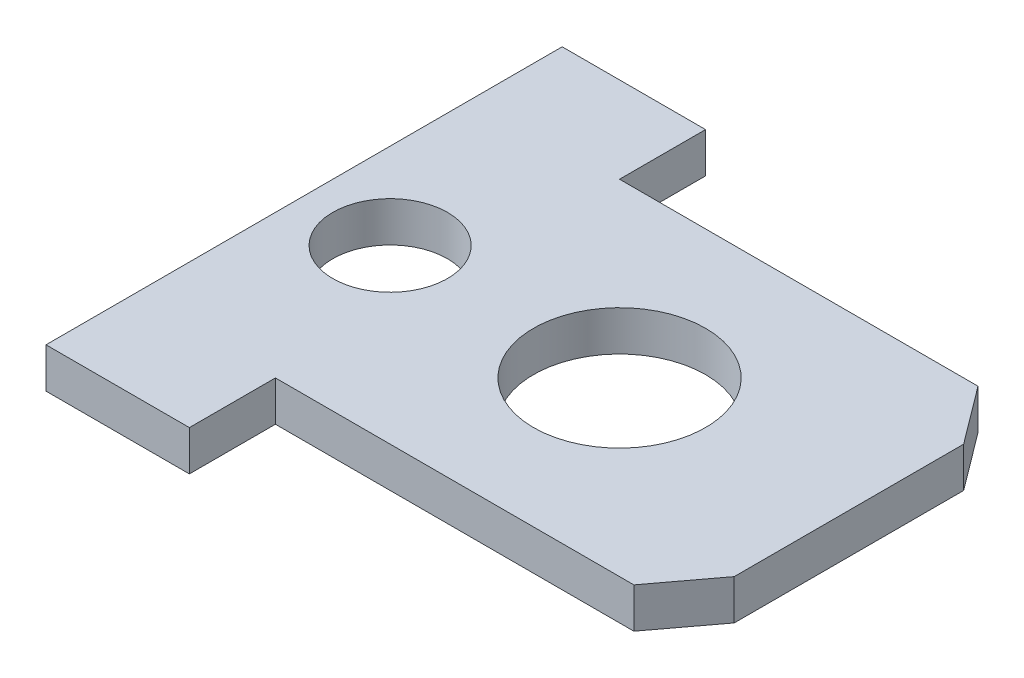
ISO-10303-21;
HEADER;
FILE_DESCRIPTION(('STEP AP214'),'2;1');
FILE_NAME('part.step','',(''),(''),'','','');
FILE_SCHEMA(('AUTOMOTIVE_DESIGN { 1 0 10303 214 1 1 1 1 }'));
ENDSEC;
DATA;
#1=APPLICATION_CONTEXT('core data for automotive mechanical design processes');
#2=APPLICATION_PROTOCOL_DEFINITION('international standard','automotive_design',2000,#1);
#3=PRODUCT_CONTEXT('',#1,'mechanical');
#4=PRODUCT('Part','Part','',(#3));
#5=PRODUCT_RELATED_PRODUCT_CATEGORY('part','',(#4));
#6=PRODUCT_DEFINITION_FORMATION('','',#4);
#7=PRODUCT_DEFINITION_CONTEXT('part definition',#1,'design');
#8=PRODUCT_DEFINITION('design','',#6,#7);
#9=PRODUCT_DEFINITION_SHAPE('','',#8);
#10=(LENGTH_UNIT() NAMED_UNIT(*) SI_UNIT(.MILLI.,.METRE.));
#11=(NAMED_UNIT(*) PLANE_ANGLE_UNIT() SI_UNIT($,.RADIAN.));
#12=(NAMED_UNIT(*) SI_UNIT($,.STERADIAN.) SOLID_ANGLE_UNIT());
#13=UNCERTAINTY_MEASURE_WITH_UNIT(LENGTH_MEASURE(1.E-05),#10,'distance_accuracy_value','');
#14=(GEOMETRIC_REPRESENTATION_CONTEXT(3) GLOBAL_UNCERTAINTY_ASSIGNED_CONTEXT((#13)) GLOBAL_UNIT_ASSIGNED_CONTEXT((#10,
#11,#12)) REPRESENTATION_CONTEXT('',''));
#15=CARTESIAN_POINT('',(0.,0.,0.));
#16=DIRECTION('',(0.,0.,1.));
#17=DIRECTION('',(1.,0.,0.));
#18=AXIS2_PLACEMENT_3D('',#15,#16,#17);
#19=CARTESIAN_POINT('',(16.,102.45,112.5));
#20=DIRECTION('',(0.,-1.,0.));
#21=DIRECTION('',(0.,0.,-1.));
#22=AXIS2_PLACEMENT_3D('',#19,#20,#21);
#23=PLANE('',#22);
#24=CARTESIAN_POINT('',(21.5,102.45,112.5));
#25=DIRECTION('',(0.,-1.,0.));
#26=DIRECTION('',(0.,0.,-1.));
#27=AXIS2_PLACEMENT_3D('',#24,#25,#26);
#28=CIRCLE('',#27,1.5);
#29=CARTESIAN_POINT('',(21.5,102.45,111.));
#30=VERTEX_POINT('',#29);
#31=EDGE_CURVE('E121',#30,#30,#28,.F.);
#32=ORIENTED_EDGE('',*,*,#31,.T.);
#33=EDGE_LOOP('',(#32));
#34=FACE_BOUND('',#33,.T.);
#35=CARTESIAN_POINT('',(17.5,102.45,112.5));
#36=DIRECTION('',(0.,-1.,0.));
#37=DIRECTION('',(0.,0.,-1.));
#38=AXIS2_PLACEMENT_3D('',#35,#36,#37);
#39=CIRCLE('',#38,1.);
#40=CARTESIAN_POINT('',(17.5,102.45,111.5));
#41=VERTEX_POINT('',#40);
#42=EDGE_CURVE('E20',#41,#41,#39,.F.);
#43=ORIENTED_EDGE('',*,*,#42,.T.);
#44=EDGE_LOOP('',(#43));
#45=FACE_BOUND('',#44,.T.);
#46=DIRECTION('',(-1.,0.,0.));
#47=VECTOR('',#46,1.);
#48=CARTESIAN_POINT('',(16.,102.45,108.));
#49=LINE('',#48,#47);
#50=CARTESIAN_POINT('',(18.5,102.45,108.));
#51=VERTEX_POINT('',#50);
#52=CARTESIAN_POINT('',(16.,102.45,108.));
#53=VERTEX_POINT('',#52);
#54=EDGE_CURVE('E152',#51,#53,#49,.T.);
#55=ORIENTED_EDGE('',*,*,#54,.F.);
#56=DIRECTION('',(0.,0.,-1.));
#57=VECTOR('',#56,1.);
#58=CARTESIAN_POINT('',(18.5,102.45,112.));
#59=LINE('',#58,#57);
#60=CARTESIAN_POINT('',(18.5,102.45,109.5));
#61=VERTEX_POINT('',#60);
#62=EDGE_CURVE('E157',#61,#51,#59,.T.);
#63=ORIENTED_EDGE('',*,*,#62,.F.);
#64=DIRECTION('',(-1.,0.,0.));
#65=VECTOR('',#64,1.);
#66=CARTESIAN_POINT('',(16.,102.45,109.5));
#67=LINE('',#66,#65);
#68=CARTESIAN_POINT('',(24.75,102.45,109.5));
#69=VERTEX_POINT('',#68);
#70=EDGE_CURVE('E162',#69,#61,#67,.T.);
#71=ORIENTED_EDGE('',*,*,#70,.F.);
#72=DIRECTION('',(-0.6,0.,-0.8));
#73=VECTOR('',#72,1.);
#74=CARTESIAN_POINT('',(25.125,102.45,110.));
#75=LINE('',#74,#73);
#76=CARTESIAN_POINT('',(25.5,102.45,110.5));
#77=VERTEX_POINT('',#76);
#78=EDGE_CURVE('E108',#77,#69,#75,.T.);
#79=ORIENTED_EDGE('',*,*,#78,.F.);
#80=DIRECTION('',(0.,0.,-1.));
#81=VECTOR('',#80,1.);
#82=CARTESIAN_POINT('',(25.5,102.45,112.));
#83=LINE('',#82,#81);
#84=CARTESIAN_POINT('',(25.5,102.45,114.5));
#85=VERTEX_POINT('',#84);
#86=EDGE_CURVE('E91',#85,#77,#83,.T.);
#87=ORIENTED_EDGE('',*,*,#86,.F.);
#88=DIRECTION('',(0.6,0.,-0.8));
#89=VECTOR('',#88,1.);
#90=CARTESIAN_POINT('',(25.125,102.45,115.));
#91=LINE('',#90,#89);
#92=CARTESIAN_POINT('',(24.75,102.45,115.5));
#93=VERTEX_POINT('',#92);
#94=EDGE_CURVE('E96',#93,#85,#91,.T.);
#95=ORIENTED_EDGE('',*,*,#94,.F.);
#96=DIRECTION('',(1.,0.,0.));
#97=VECTOR('',#96,1.);
#98=CARTESIAN_POINT('',(16.,102.45,115.5));
#99=LINE('',#98,#97);
#100=CARTESIAN_POINT('',(18.5,102.45,115.5));
#101=VERTEX_POINT('',#100);
#102=EDGE_CURVE('E128',#101,#93,#99,.T.);
#103=ORIENTED_EDGE('',*,*,#102,.F.);
#104=DIRECTION('',(0.,0.,-1.));
#105=VECTOR('',#104,1.);
#106=CARTESIAN_POINT('',(18.5,102.45,112.));
#107=LINE('',#106,#105);
#108=CARTESIAN_POINT('',(18.5,102.45,117.));
#109=VERTEX_POINT('',#108);
#110=EDGE_CURVE('E137',#109,#101,#107,.T.);
#111=ORIENTED_EDGE('',*,*,#110,.F.);
#112=DIRECTION('',(1.,0.,0.));
#113=VECTOR('',#112,1.);
#114=CARTESIAN_POINT('',(16.,102.45,117.));
#115=LINE('',#114,#113);
#116=CARTESIAN_POINT('',(16.,102.45,117.));
#117=VERTEX_POINT('',#116);
#118=EDGE_CURVE('E142',#117,#109,#115,.T.);
#119=ORIENTED_EDGE('',*,*,#118,.F.);
#120=DIRECTION('',(0.,0.,-1.));
#121=VECTOR('',#120,1.);
#122=CARTESIAN_POINT('',(16.,102.45,112.));
#123=LINE('',#122,#121);
#124=EDGE_CURVE('E147',#117,#53,#123,.T.);
#125=ORIENTED_EDGE('',*,*,#124,.T.);
#126=EDGE_LOOP('',(#55,#63,#71,#79,#87,#95,#103,#111,#119,#125));
#127=FACE_BOUND('',#126,.T.);
#128=ADVANCED_FACE('F17',(#34,#45,#127),#23,.T.);
#129=CARTESIAN_POINT('',(25.125,102.45,115.));
#130=DIRECTION('',(0.8,0.,0.6));
#131=DIRECTION('',(0.6,0.,-0.8));
#132=AXIS2_PLACEMENT_3D('',#129,#130,#131);
#133=PLANE('',#132);
#134=ORIENTED_EDGE('',*,*,#94,.T.);
#135=DIRECTION('',(0.,1.,0.));
#136=VECTOR('',#135,1.);
#137=CARTESIAN_POINT('',(25.5,102.8,114.5));
#138=LINE('',#137,#136);
#139=CARTESIAN_POINT('',(25.5,103.15,114.5));
#140=VERTEX_POINT('',#139);
#141=EDGE_CURVE('E98',#140,#85,#138,.F.);
#142=ORIENTED_EDGE('',*,*,#141,.F.);
#143=DIRECTION('',(0.6,0.,-0.8));
#144=VECTOR('',#143,1.);
#145=CARTESIAN_POINT('',(24.75,103.15,115.5));
#146=LINE('',#145,#144);
#147=CARTESIAN_POINT('',(24.75,103.15,115.5));
#148=VERTEX_POINT('',#147);
#149=EDGE_CURVE('E123',#148,#140,#146,.T.);
#150=ORIENTED_EDGE('',*,*,#149,.F.);
#151=DIRECTION('',(0.,1.,0.));
#152=VECTOR('',#151,1.);
#153=CARTESIAN_POINT('',(24.75,102.8,115.5));
#154=LINE('',#153,#152);
#155=EDGE_CURVE('E101',#93,#148,#154,.T.);
#156=ORIENTED_EDGE('',*,*,#155,.F.);
#157=EDGE_LOOP('',(#134,#142,#150,#156));
#158=FACE_BOUND('',#157,.T.);
#159=ADVANCED_FACE('F97',(#158),#133,.T.);
#160=CARTESIAN_POINT('',(25.5,102.8,112.));
#161=DIRECTION('',(1.,0.,0.));
#162=DIRECTION('',(0.,0.,-1.));
#163=AXIS2_PLACEMENT_3D('',#160,#161,#162);
#164=PLANE('',#163);
#165=ORIENTED_EDGE('',*,*,#141,.T.);
#166=ORIENTED_EDGE('',*,*,#86,.T.);
#167=DIRECTION('',(0.,1.,0.));
#168=VECTOR('',#167,1.);
#169=CARTESIAN_POINT('',(25.5,102.45,110.5));
#170=LINE('',#169,#168);
#171=CARTESIAN_POINT('',(25.5,103.15,110.5));
#172=VERTEX_POINT('',#171);
#173=EDGE_CURVE('E110',#172,#77,#170,.F.);
#174=ORIENTED_EDGE('',*,*,#173,.F.);
#175=DIRECTION('',(0.,0.,1.));
#176=VECTOR('',#175,1.);
#177=CARTESIAN_POINT('',(25.5,103.15,112.5));
#178=LINE('',#177,#176);
#179=EDGE_CURVE('E114',#140,#172,#178,.F.);
#180=ORIENTED_EDGE('',*,*,#179,.F.);
#181=EDGE_LOOP('',(#165,#166,#174,#180));
#182=FACE_BOUND('',#181,.T.);
#183=ADVANCED_FACE('F112',(#182),#164,.T.);
#184=CARTESIAN_POINT('',(25.125,102.45,110.));
#185=DIRECTION('',(0.8,0.,-0.6));
#186=DIRECTION('',(-0.6,0.,-0.8));
#187=AXIS2_PLACEMENT_3D('',#184,#185,#186);
#188=PLANE('',#187);
#189=ORIENTED_EDGE('',*,*,#78,.T.);
#190=DIRECTION('',(0.,1.,0.));
#191=VECTOR('',#190,1.);
#192=CARTESIAN_POINT('',(24.75,102.8,109.5));
#193=LINE('',#192,#191);
#194=CARTESIAN_POINT('',(24.75,103.15,109.5));
#195=VERTEX_POINT('',#194);
#196=EDGE_CURVE('E164',#195,#69,#193,.F.);
#197=ORIENTED_EDGE('',*,*,#196,.F.);
#198=DIRECTION('',(-0.6,0.,-0.8));
#199=VECTOR('',#198,1.);
#200=CARTESIAN_POINT('',(25.5,103.15,110.5));
#201=LINE('',#200,#199);
#202=EDGE_CURVE('E171',#172,#195,#201,.T.);
#203=ORIENTED_EDGE('',*,*,#202,.F.);
#204=ORIENTED_EDGE('',*,*,#173,.T.);
#205=EDGE_LOOP('',(#189,#197,#203,#204));
#206=FACE_BOUND('',#205,.T.);
#207=ADVANCED_FACE('F169',(#206),#188,.T.);
#208=CARTESIAN_POINT('',(16.,102.8,109.5));
#209=DIRECTION('',(0.,0.,-1.));
#210=DIRECTION('',(-1.,0.,0.));
#211=AXIS2_PLACEMENT_3D('',#208,#209,#210);
#212=PLANE('',#211);
#213=ORIENTED_EDGE('',*,*,#70,.T.);
#214=DIRECTION('',(0.,1.,0.));
#215=VECTOR('',#214,1.);
#216=CARTESIAN_POINT('',(18.5,102.8,109.5));
#217=LINE('',#216,#215);
#218=CARTESIAN_POINT('',(18.5,103.15,109.5));
#219=VERTEX_POINT('',#218);
#220=EDGE_CURVE('E159',#219,#61,#217,.F.);
#221=ORIENTED_EDGE('',*,*,#220,.F.);
#222=DIRECTION('',(1.,0.,0.));
#223=VECTOR('',#222,1.);
#224=CARTESIAN_POINT('',(16.,103.15,109.5));
#225=LINE('',#224,#223);
#226=EDGE_CURVE('E175',#195,#219,#225,.F.);
#227=ORIENTED_EDGE('',*,*,#226,.F.);
#228=ORIENTED_EDGE('',*,*,#196,.T.);
#229=EDGE_LOOP('',(#213,#221,#227,#228));
#230=FACE_BOUND('',#229,.T.);
#231=ADVANCED_FACE('F284',(#230),#212,.T.);
#232=CARTESIAN_POINT('',(18.5,102.8,112.));
#233=DIRECTION('',(1.,0.,0.));
#234=DIRECTION('',(0.,0.,-1.));
#235=AXIS2_PLACEMENT_3D('',#232,#233,#234);
#236=PLANE('',#235);
#237=ORIENTED_EDGE('',*,*,#220,.T.);
#238=ORIENTED_EDGE('',*,*,#62,.T.);
#239=DIRECTION('',(0.,1.,0.));
#240=VECTOR('',#239,1.);
#241=CARTESIAN_POINT('',(18.5,102.8,108.));
#242=LINE('',#241,#240);
#243=CARTESIAN_POINT('',(18.5,103.15,108.));
#244=VERTEX_POINT('',#243);
#245=EDGE_CURVE('E154',#244,#51,#242,.F.);
#246=ORIENTED_EDGE('',*,*,#245,.F.);
#247=DIRECTION('',(0.,0.,1.));
#248=VECTOR('',#247,1.);
#249=CARTESIAN_POINT('',(18.5,103.15,112.5));
#250=LINE('',#249,#248);
#251=EDGE_CURVE('E182',#219,#244,#250,.F.);
#252=ORIENTED_EDGE('',*,*,#251,.F.);
#253=EDGE_LOOP('',(#237,#238,#246,#252));
#254=FACE_BOUND('',#253,.T.);
#255=ADVANCED_FACE('F274',(#254),#236,.T.);
#256=CARTESIAN_POINT('',(16.,102.8,108.));
#257=DIRECTION('',(0.,0.,-1.));
#258=DIRECTION('',(-1.,0.,0.));
#259=AXIS2_PLACEMENT_3D('',#256,#257,#258);
#260=PLANE('',#259);
#261=ORIENTED_EDGE('',*,*,#245,.T.);
#262=ORIENTED_EDGE('',*,*,#54,.T.);
#263=DIRECTION('',(0.,1.,0.));
#264=VECTOR('',#263,1.);
#265=CARTESIAN_POINT('',(16.,102.8,108.));
#266=LINE('',#265,#264);
#267=CARTESIAN_POINT('',(16.,103.15,108.));
#268=VERTEX_POINT('',#267);
#269=EDGE_CURVE('E150',#53,#268,#266,.T.);
#270=ORIENTED_EDGE('',*,*,#269,.T.);
#271=DIRECTION('',(1.,0.,0.));
#272=VECTOR('',#271,1.);
#273=CARTESIAN_POINT('',(16.,103.15,108.));
#274=LINE('',#273,#272);
#275=EDGE_CURVE('E185',#244,#268,#274,.F.);
#276=ORIENTED_EDGE('',*,*,#275,.F.);
#277=EDGE_LOOP('',(#261,#262,#270,#276));
#278=FACE_BOUND('',#277,.T.);
#279=ADVANCED_FACE('F264',(#278),#260,.T.);
#280=CARTESIAN_POINT('',(16.,102.8,112.));
#281=DIRECTION('',(1.,0.,0.));
#282=DIRECTION('',(0.,0.,-1.));
#283=AXIS2_PLACEMENT_3D('',#280,#281,#282);
#284=PLANE('',#283);
#285=DIRECTION('',(0.,1.,0.));
#286=VECTOR('',#285,1.);
#287=CARTESIAN_POINT('',(16.,102.8,117.));
#288=LINE('',#287,#286);
#289=CARTESIAN_POINT('',(16.,103.15,117.));
#290=VERTEX_POINT('',#289);
#291=EDGE_CURVE('E144',#290,#117,#288,.F.);
#292=ORIENTED_EDGE('',*,*,#291,.F.);
#293=DIRECTION('',(0.,0.,1.));
#294=VECTOR('',#293,1.);
#295=CARTESIAN_POINT('',(16.,103.15,112.5));
#296=LINE('',#295,#294);
#297=EDGE_CURVE('E188',#268,#290,#296,.T.);
#298=ORIENTED_EDGE('',*,*,#297,.F.);
#299=ORIENTED_EDGE('',*,*,#269,.F.);
#300=ORIENTED_EDGE('',*,*,#124,.F.);
#301=EDGE_LOOP('',(#292,#298,#299,#300));
#302=FACE_BOUND('',#301,.T.);
#303=ADVANCED_FACE('F254',(#302),#284,.F.);
#304=CARTESIAN_POINT('',(16.,102.8,117.));
#305=DIRECTION('',(0.,0.,1.));
#306=DIRECTION('',(1.,0.,0.));
#307=AXIS2_PLACEMENT_3D('',#304,#305,#306);
#308=PLANE('',#307);
#309=ORIENTED_EDGE('',*,*,#291,.T.);
#310=ORIENTED_EDGE('',*,*,#118,.T.);
#311=DIRECTION('',(0.,1.,0.));
#312=VECTOR('',#311,1.);
#313=CARTESIAN_POINT('',(18.5,102.8,117.));
#314=LINE('',#313,#312);
#315=CARTESIAN_POINT('',(18.5,103.15,117.));
#316=VERTEX_POINT('',#315);
#317=EDGE_CURVE('E139',#316,#109,#314,.F.);
#318=ORIENTED_EDGE('',*,*,#317,.F.);
#319=DIRECTION('',(1.,0.,0.));
#320=VECTOR('',#319,1.);
#321=CARTESIAN_POINT('',(16.,103.15,117.));
#322=LINE('',#321,#320);
#323=EDGE_CURVE('E191',#290,#316,#322,.T.);
#324=ORIENTED_EDGE('',*,*,#323,.F.);
#325=EDGE_LOOP('',(#309,#310,#318,#324));
#326=FACE_BOUND('',#325,.T.);
#327=ADVANCED_FACE('F209',(#326),#308,.T.);
#328=CARTESIAN_POINT('',(18.5,102.8,112.));
#329=DIRECTION('',(1.,0.,0.));
#330=DIRECTION('',(0.,0.,-1.));
#331=AXIS2_PLACEMENT_3D('',#328,#329,#330);
#332=PLANE('',#331);
#333=ORIENTED_EDGE('',*,*,#110,.T.);
#334=DIRECTION('',(0.,1.,0.));
#335=VECTOR('',#334,1.);
#336=CARTESIAN_POINT('',(18.5,102.8,115.5));
#337=LINE('',#336,#335);
#338=CARTESIAN_POINT('',(18.5,103.15,115.5));
#339=VERTEX_POINT('',#338);
#340=EDGE_CURVE('E35',#339,#101,#337,.F.);
#341=ORIENTED_EDGE('',*,*,#340,.F.);
#342=DIRECTION('',(0.,0.,1.));
#343=VECTOR('',#342,1.);
#344=CARTESIAN_POINT('',(18.5,103.15,112.5));
#345=LINE('',#344,#343);
#346=EDGE_CURVE('E194',#316,#339,#345,.F.);
#347=ORIENTED_EDGE('',*,*,#346,.F.);
#348=ORIENTED_EDGE('',*,*,#317,.T.);
#349=EDGE_LOOP('',(#333,#341,#347,#348));
#350=FACE_BOUND('',#349,.T.);
#351=ADVANCED_FACE('F199',(#350),#332,.T.);
#352=CARTESIAN_POINT('',(16.,102.8,115.5));
#353=DIRECTION('',(0.,0.,1.));
#354=DIRECTION('',(1.,0.,0.));
#355=AXIS2_PLACEMENT_3D('',#352,#353,#354);
#356=PLANE('',#355);
#357=ORIENTED_EDGE('',*,*,#340,.T.);
#358=ORIENTED_EDGE('',*,*,#102,.T.);
#359=ORIENTED_EDGE('',*,*,#155,.T.);
#360=DIRECTION('',(1.,0.,0.));
#361=VECTOR('',#360,1.);
#362=CARTESIAN_POINT('',(16.,103.15,115.5));
#363=LINE('',#362,#361);
#364=EDGE_CURVE('E120',#339,#148,#363,.T.);
#365=ORIENTED_EDGE('',*,*,#364,.F.);
#366=EDGE_LOOP('',(#357,#358,#359,#365));
#367=FACE_BOUND('',#366,.T.);
#368=ADVANCED_FACE('F196',(#367),#356,.T.);
#369=CARTESIAN_POINT('',(17.5,102.45,112.5));
#370=DIRECTION('',(0.,-1.,0.));
#371=DIRECTION('',(0.,0.,-1.));
#372=AXIS2_PLACEMENT_3D('',#369,#370,#371);
#373=CYLINDRICAL_SURFACE('',#372,1.);
#374=ORIENTED_EDGE('',*,*,#42,.F.);
#375=EDGE_LOOP('',(#374));
#376=FACE_BOUND('',#375,.T.);
#377=CARTESIAN_POINT('',(17.5,103.15,112.5));
#378=DIRECTION('',(0.,-1.,0.));
#379=DIRECTION('',(0.,0.,-1.));
#380=AXIS2_PLACEMENT_3D('',#377,#378,#379);
#381=CIRCLE('',#380,1.);
#382=CARTESIAN_POINT('',(17.5,103.15,111.5));
#383=VERTEX_POINT('',#382);
#384=EDGE_CURVE('E26',#383,#383,#381,.T.);
#385=ORIENTED_EDGE('',*,*,#384,.F.);
#386=EDGE_LOOP('',(#385));
#387=FACE_BOUND('',#386,.T.);
#388=ADVANCED_FACE('F198',(#376,#387),#373,.F.);
#389=CARTESIAN_POINT('',(21.5,102.45,112.5));
#390=DIRECTION('',(0.,-1.,0.));
#391=DIRECTION('',(0.,0.,-1.));
#392=AXIS2_PLACEMENT_3D('',#389,#390,#391);
#393=CYLINDRICAL_SURFACE('',#392,1.5);
#394=ORIENTED_EDGE('',*,*,#31,.F.);
#395=EDGE_LOOP('',(#394));
#396=FACE_BOUND('',#395,.T.);
#397=CARTESIAN_POINT('',(21.5,103.15,112.5));
#398=DIRECTION('',(0.,-1.,0.));
#399=DIRECTION('',(0.,0.,-1.));
#400=AXIS2_PLACEMENT_3D('',#397,#398,#399);
#401=CIRCLE('',#400,1.5);
#402=CARTESIAN_POINT('',(21.5,103.15,111.));
#403=VERTEX_POINT('',#402);
#404=EDGE_CURVE('E11',#403,#403,#401,.T.);
#405=ORIENTED_EDGE('',*,*,#404,.F.);
#406=EDGE_LOOP('',(#405));
#407=FACE_BOUND('',#406,.T.);
#408=ADVANCED_FACE('F206',(#396,#407),#393,.F.);
#409=CARTESIAN_POINT('',(16.,103.15,112.5));
#410=DIRECTION('',(0.,1.,0.));
#411=DIRECTION('',(0.,0.,1.));
#412=AXIS2_PLACEMENT_3D('',#409,#410,#411);
#413=PLANE('',#412);
#414=ORIENTED_EDGE('',*,*,#404,.T.);
#415=EDGE_LOOP('',(#414));
#416=FACE_BOUND('',#415,.T.);
#417=ORIENTED_EDGE('',*,*,#384,.T.);
#418=EDGE_LOOP('',(#417));
#419=FACE_BOUND('',#418,.T.);
#420=ORIENTED_EDGE('',*,*,#346,.T.);
#421=ORIENTED_EDGE('',*,*,#364,.T.);
#422=ORIENTED_EDGE('',*,*,#149,.T.);
#423=ORIENTED_EDGE('',*,*,#179,.T.);
#424=ORIENTED_EDGE('',*,*,#202,.T.);
#425=ORIENTED_EDGE('',*,*,#226,.T.);
#426=ORIENTED_EDGE('',*,*,#251,.T.);
#427=ORIENTED_EDGE('',*,*,#275,.T.);
#428=ORIENTED_EDGE('',*,*,#297,.T.);
#429=ORIENTED_EDGE('',*,*,#323,.T.);
#430=EDGE_LOOP('',(#420,#421,#422,#423,#424,#425,#426,#427,#428,#429));
#431=FACE_BOUND('',#430,.T.);
#432=ADVANCED_FACE('F178',(#416,#419,#431),#413,.T.);
#433=CLOSED_SHELL('',(#128,#159,#183,#207,#231,#255,#279,#303,#327,#351,#368,#388,#408,#432));
#434=MANIFOLD_SOLID_BREP('B1',#433);
#435=ADVANCED_BREP_SHAPE_REPRESENTATION('',(#18,#434),#14);
#436=SHAPE_DEFINITION_REPRESENTATION(#9,#435);
ENDSEC;
END-ISO-10303-21;
